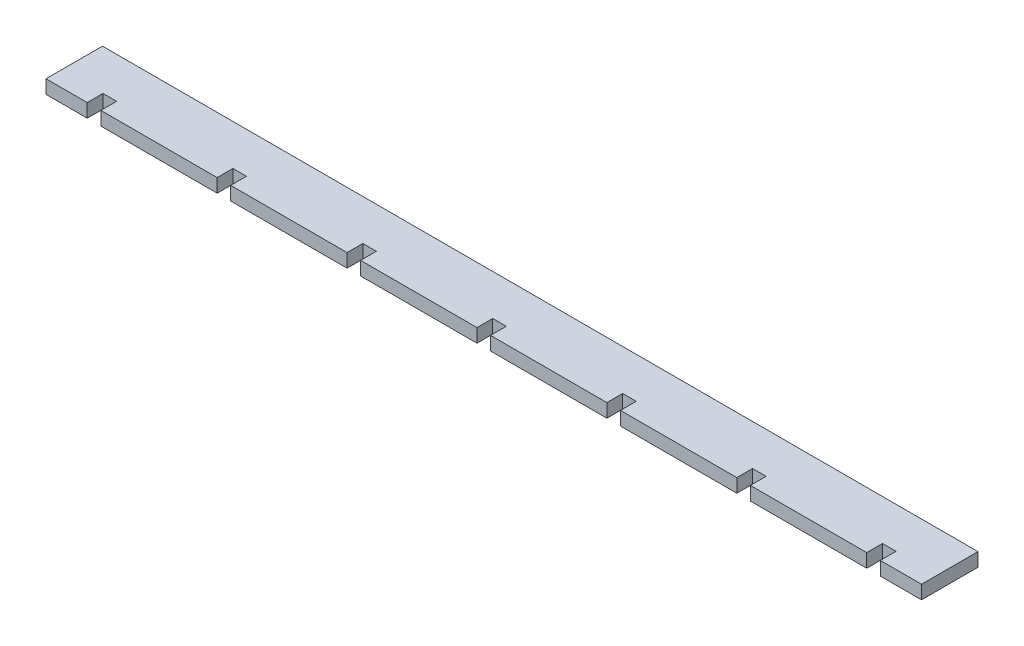
ISO-10303-21;
HEADER;
FILE_DESCRIPTION(('STEP AP214'),'2;1');
FILE_NAME('part.step','',(''),(''),'','','');
FILE_SCHEMA(('AUTOMOTIVE_DESIGN { 1 0 10303 214 1 1 1 1 }'));
ENDSEC;
DATA;
#1=APPLICATION_CONTEXT('core data for automotive mechanical design processes');
#2=APPLICATION_PROTOCOL_DEFINITION('international standard','automotive_design',2000,#1);
#3=PRODUCT_CONTEXT('',#1,'mechanical');
#4=PRODUCT('Part','Part','',(#3));
#5=PRODUCT_RELATED_PRODUCT_CATEGORY('part','',(#4));
#6=PRODUCT_DEFINITION_FORMATION('','',#4);
#7=PRODUCT_DEFINITION_CONTEXT('part definition',#1,'design');
#8=PRODUCT_DEFINITION('design','',#6,#7);
#9=PRODUCT_DEFINITION_SHAPE('','',#8);
#10=(LENGTH_UNIT() NAMED_UNIT(*) SI_UNIT(.MILLI.,.METRE.));
#11=(NAMED_UNIT(*) PLANE_ANGLE_UNIT() SI_UNIT($,.RADIAN.));
#12=(NAMED_UNIT(*) SI_UNIT($,.STERADIAN.) SOLID_ANGLE_UNIT());
#13=UNCERTAINTY_MEASURE_WITH_UNIT(LENGTH_MEASURE(1.E-05),#10,'distance_accuracy_value','');
#14=(GEOMETRIC_REPRESENTATION_CONTEXT(3) GLOBAL_UNCERTAINTY_ASSIGNED_CONTEXT((#13)) GLOBAL_UNIT_ASSIGNED_CONTEXT((#10,
#11,#12)) REPRESENTATION_CONTEXT('',''));
#15=CARTESIAN_POINT('',(0.,0.,0.));
#16=DIRECTION('',(0.,0.,1.));
#17=DIRECTION('',(1.,0.,0.));
#18=AXIS2_PLACEMENT_3D('',#15,#16,#17);
#19=CARTESIAN_POINT('',(-98.425,3.048,0.));
#20=DIRECTION('',(0.,0.,-1.));
#21=DIRECTION('',(-1.,0.,0.));
#22=AXIS2_PLACEMENT_3D('',#19,#20,#21);
#23=PLANE('',#22);
#24=DIRECTION('',(1.,0.,0.));
#25=VECTOR('',#24,1.);
#26=CARTESIAN_POINT('',(-98.425,0.,0.));
#27=LINE('',#26,#25);
#28=CARTESIAN_POINT('',(-98.425,0.,0.));
#29=VERTEX_POINT('',#28);
#30=CARTESIAN_POINT('',(-89.154,0.,0.));
#31=VERTEX_POINT('',#30);
#32=EDGE_CURVE('E328',#29,#31,#27,.T.);
#33=ORIENTED_EDGE('',*,*,#32,.T.);
#34=DIRECTION('',(0.,1.,0.));
#35=VECTOR('',#34,1.);
#36=CARTESIAN_POINT('',(-89.154,0.,0.));
#37=LINE('',#36,#35);
#38=CARTESIAN_POINT('',(-89.154,3.048,0.));
#39=VERTEX_POINT('',#38);
#40=EDGE_CURVE('E313',#31,#39,#37,.T.);
#41=ORIENTED_EDGE('',*,*,#40,.T.);
#42=DIRECTION('',(1.,0.,0.));
#43=VECTOR('',#42,1.);
#44=CARTESIAN_POINT('',(-98.425,3.048,0.));
#45=LINE('',#44,#43);
#46=CARTESIAN_POINT('',(-98.425,3.048,0.));
#47=VERTEX_POINT('',#46);
#48=EDGE_CURVE('E381',#47,#39,#45,.T.);
#49=ORIENTED_EDGE('',*,*,#48,.F.);
#50=DIRECTION('',(0.,-1.,0.));
#51=VECTOR('',#50,1.);
#52=CARTESIAN_POINT('',(-98.425,3.048,0.));
#53=LINE('',#52,#51);
#54=EDGE_CURVE('E12',#47,#29,#53,.T.);
#55=ORIENTED_EDGE('',*,*,#54,.T.);
#56=EDGE_LOOP('',(#33,#41,#49,#55));
#57=FACE_BOUND('',#56,.T.);
#58=ADVANCED_FACE('F41',(#57),#23,.F.);
#59=CARTESIAN_POINT('',(-86.106,3.048,0.));
#60=VERTEX_POINT('',#59);
#61=CARTESIAN_POINT('',(-59.944,3.048,0.));
#62=VERTEX_POINT('',#61);
#63=EDGE_CURVE('E384',#60,#62,#45,.T.);
#64=ORIENTED_EDGE('',*,*,#63,.F.);
#65=DIRECTION('',(0.,1.,0.));
#66=VECTOR('',#65,1.);
#67=CARTESIAN_POINT('',(-86.106,0.,0.));
#68=LINE('',#67,#66);
#69=CARTESIAN_POINT('',(-86.106,0.,0.));
#70=VERTEX_POINT('',#69);
#71=EDGE_CURVE('E323',#70,#60,#68,.T.);
#72=ORIENTED_EDGE('',*,*,#71,.F.);
#73=CARTESIAN_POINT('',(-59.944,0.,0.));
#74=VERTEX_POINT('',#73);
#75=EDGE_CURVE('E338',#70,#74,#27,.T.);
#76=ORIENTED_EDGE('',*,*,#75,.T.);
#77=DIRECTION('',(0.,1.,0.));
#78=VECTOR('',#77,1.);
#79=CARTESIAN_POINT('',(-59.944,0.,0.));
#80=LINE('',#79,#78);
#81=EDGE_CURVE('E650',#74,#62,#80,.T.);
#82=ORIENTED_EDGE('',*,*,#81,.T.);
#83=EDGE_LOOP('',(#64,#72,#76,#82));
#84=FACE_BOUND('',#83,.T.);
#85=ADVANCED_FACE('F517',(#84),#23,.F.);
#86=CARTESIAN_POINT('',(-56.896,3.048,0.));
#87=VERTEX_POINT('',#86);
#88=CARTESIAN_POINT('',(-30.734,3.048,0.));
#89=VERTEX_POINT('',#88);
#90=EDGE_CURVE('E849',#87,#89,#45,.T.);
#91=ORIENTED_EDGE('',*,*,#90,.F.);
#92=DIRECTION('',(0.,1.,0.));
#93=VECTOR('',#92,1.);
#94=CARTESIAN_POINT('',(-56.896,0.,0.));
#95=LINE('',#94,#93);
#96=CARTESIAN_POINT('',(-56.896,0.,0.));
#97=VERTEX_POINT('',#96);
#98=EDGE_CURVE('E670',#97,#87,#95,.T.);
#99=ORIENTED_EDGE('',*,*,#98,.F.);
#100=CARTESIAN_POINT('',(-30.734,0.,0.));
#101=VERTEX_POINT('',#100);
#102=EDGE_CURVE('E345',#97,#101,#27,.T.);
#103=ORIENTED_EDGE('',*,*,#102,.T.);
#104=DIRECTION('',(0.,1.,0.));
#105=VECTOR('',#104,1.);
#106=CARTESIAN_POINT('',(-30.734,0.,0.));
#107=LINE('',#106,#105);
#108=EDGE_CURVE('E689',#101,#89,#107,.T.);
#109=ORIENTED_EDGE('',*,*,#108,.T.);
#110=EDGE_LOOP('',(#91,#99,#103,#109));
#111=FACE_BOUND('',#110,.T.);
#112=ADVANCED_FACE('F523',(#111),#23,.F.);
#113=CARTESIAN_POINT('',(-27.686,3.048,0.));
#114=VERTEX_POINT('',#113);
#115=CARTESIAN_POINT('',(-1.524,3.048,0.));
#116=VERTEX_POINT('',#115);
#117=EDGE_CURVE('E853',#114,#116,#45,.T.);
#118=ORIENTED_EDGE('',*,*,#117,.F.);
#119=DIRECTION('',(0.,1.,0.));
#120=VECTOR('',#119,1.);
#121=CARTESIAN_POINT('',(-27.686,0.,0.));
#122=LINE('',#121,#120);
#123=CARTESIAN_POINT('',(-27.686,0.,0.));
#124=VERTEX_POINT('',#123);
#125=EDGE_CURVE('E709',#124,#114,#122,.T.);
#126=ORIENTED_EDGE('',*,*,#125,.F.);
#127=CARTESIAN_POINT('',(-1.524,0.,0.));
#128=VERTEX_POINT('',#127);
#129=EDGE_CURVE('E824',#124,#128,#27,.T.);
#130=ORIENTED_EDGE('',*,*,#129,.T.);
#131=DIRECTION('',(0.,1.,0.));
#132=VECTOR('',#131,1.);
#133=CARTESIAN_POINT('',(-1.524,0.,0.));
#134=LINE('',#133,#132);
#135=EDGE_CURVE('E728',#128,#116,#134,.T.);
#136=ORIENTED_EDGE('',*,*,#135,.T.);
#137=EDGE_LOOP('',(#118,#126,#130,#136));
#138=FACE_BOUND('',#137,.T.);
#139=ADVANCED_FACE('F875',(#138),#23,.F.);
#140=CARTESIAN_POINT('',(1.524,3.048,0.));
#141=VERTEX_POINT('',#140);
#142=CARTESIAN_POINT('',(27.686,3.048,0.));
#143=VERTEX_POINT('',#142);
#144=EDGE_CURVE('E857',#141,#143,#45,.T.);
#145=ORIENTED_EDGE('',*,*,#144,.F.);
#146=DIRECTION('',(0.,1.,0.));
#147=VECTOR('',#146,1.);
#148=CARTESIAN_POINT('',(1.524,0.,0.));
#149=LINE('',#148,#147);
#150=CARTESIAN_POINT('',(1.524,0.,0.));
#151=VERTEX_POINT('',#150);
#152=EDGE_CURVE('E748',#151,#141,#149,.T.);
#153=ORIENTED_EDGE('',*,*,#152,.F.);
#154=CARTESIAN_POINT('',(27.686,0.,0.));
#155=VERTEX_POINT('',#154);
#156=EDGE_CURVE('E822',#151,#155,#27,.T.);
#157=ORIENTED_EDGE('',*,*,#156,.T.);
#158=DIRECTION('',(0.,1.,0.));
#159=VECTOR('',#158,1.);
#160=CARTESIAN_POINT('',(27.686,0.,0.));
#161=LINE('',#160,#159);
#162=EDGE_CURVE('E767',#155,#143,#161,.T.);
#163=ORIENTED_EDGE('',*,*,#162,.T.);
#164=EDGE_LOOP('',(#145,#153,#157,#163));
#165=FACE_BOUND('',#164,.T.);
#166=ADVANCED_FACE('F870',(#165),#23,.F.);
#167=CARTESIAN_POINT('',(30.734,3.048,0.));
#168=VERTEX_POINT('',#167);
#169=CARTESIAN_POINT('',(56.896,3.048,0.));
#170=VERTEX_POINT('',#169);
#171=EDGE_CURVE('E486',#168,#170,#45,.T.);
#172=ORIENTED_EDGE('',*,*,#171,.F.);
#173=DIRECTION('',(0.,1.,0.));
#174=VECTOR('',#173,1.);
#175=CARTESIAN_POINT('',(30.734,0.,0.));
#176=LINE('',#175,#174);
#177=CARTESIAN_POINT('',(30.734,0.,0.));
#178=VERTEX_POINT('',#177);
#179=EDGE_CURVE('E787',#178,#168,#176,.T.);
#180=ORIENTED_EDGE('',*,*,#179,.F.);
#181=CARTESIAN_POINT('',(56.896,0.,0.));
#182=VERTEX_POINT('',#181);
#183=EDGE_CURVE('E358',#178,#182,#27,.T.);
#184=ORIENTED_EDGE('',*,*,#183,.T.);
#185=DIRECTION('',(0.,1.,0.));
#186=VECTOR('',#185,1.);
#187=CARTESIAN_POINT('',(56.896,0.,0.));
#188=LINE('',#187,#186);
#189=EDGE_CURVE('E473',#182,#170,#188,.T.);
#190=ORIENTED_EDGE('',*,*,#189,.T.);
#191=EDGE_LOOP('',(#172,#180,#184,#190));
#192=FACE_BOUND('',#191,.T.);
#193=ADVANCED_FACE('F514',(#192),#23,.F.);
#194=CARTESIAN_POINT('',(59.944,3.048,0.));
#195=VERTEX_POINT('',#194);
#196=CARTESIAN_POINT('',(86.106,3.048,0.));
#197=VERTEX_POINT('',#196);
#198=EDGE_CURVE('E483',#195,#197,#45,.T.);
#199=ORIENTED_EDGE('',*,*,#198,.F.);
#200=DIRECTION('',(0.,1.,0.));
#201=VECTOR('',#200,1.);
#202=CARTESIAN_POINT('',(59.944,0.,0.));
#203=LINE('',#202,#201);
#204=CARTESIAN_POINT('',(59.944,0.,0.));
#205=VERTEX_POINT('',#204);
#206=EDGE_CURVE('E465',#205,#195,#203,.T.);
#207=ORIENTED_EDGE('',*,*,#206,.F.);
#208=CARTESIAN_POINT('',(86.106,0.,0.));
#209=VERTEX_POINT('',#208);
#210=EDGE_CURVE('E348',#205,#209,#27,.T.);
#211=ORIENTED_EDGE('',*,*,#210,.T.);
#212=DIRECTION('',(0.,1.,0.));
#213=VECTOR('',#212,1.);
#214=CARTESIAN_POINT('',(86.106,0.,0.));
#215=LINE('',#214,#213);
#216=EDGE_CURVE('E360',#209,#197,#215,.T.);
#217=ORIENTED_EDGE('',*,*,#216,.T.);
#218=EDGE_LOOP('',(#199,#207,#211,#217));
#219=FACE_BOUND('',#218,.T.);
#220=ADVANCED_FACE('F508',(#219),#23,.F.);
#221=CARTESIAN_POINT('',(-98.425,3.048,0.));
#222=DIRECTION('',(1.,0.,0.));
#223=DIRECTION('',(0.,0.,-1.));
#224=AXIS2_PLACEMENT_3D('',#221,#222,#223);
#225=PLANE('',#224);
#226=DIRECTION('',(0.,0.,1.));
#227=VECTOR('',#226,1.);
#228=CARTESIAN_POINT('',(-98.425,0.,0.));
#229=LINE('',#228,#227);
#230=CARTESIAN_POINT('',(-98.425,0.,-12.7));
#231=VERTEX_POINT('',#230);
#232=EDGE_CURVE('E349',#231,#29,#229,.T.);
#233=ORIENTED_EDGE('',*,*,#232,.T.);
#234=ORIENTED_EDGE('',*,*,#54,.F.);
#235=DIRECTION('',(0.,0.,1.));
#236=VECTOR('',#235,1.);
#237=CARTESIAN_POINT('',(-98.425,3.048,0.));
#238=LINE('',#237,#236);
#239=CARTESIAN_POINT('',(-98.425,3.048,-12.7));
#240=VERTEX_POINT('',#239);
#241=EDGE_CURVE('E386',#240,#47,#238,.T.);
#242=ORIENTED_EDGE('',*,*,#241,.F.);
#243=DIRECTION('',(0.,-1.,0.));
#244=VECTOR('',#243,1.);
#245=CARTESIAN_POINT('',(-98.425,3.048,-12.7));
#246=LINE('',#245,#244);
#247=EDGE_CURVE('E372',#240,#231,#246,.T.);
#248=ORIENTED_EDGE('',*,*,#247,.T.);
#249=EDGE_LOOP('',(#233,#234,#242,#248));
#250=FACE_BOUND('',#249,.T.);
#251=ADVANCED_FACE('F43',(#250),#225,.F.);
#252=CARTESIAN_POINT('',(89.154,3.048,0.));
#253=VERTEX_POINT('',#252);
#254=CARTESIAN_POINT('',(98.425,3.048,0.));
#255=VERTEX_POINT('',#254);
#256=EDGE_CURVE('E385',#253,#255,#45,.T.);
#257=ORIENTED_EDGE('',*,*,#256,.F.);
#258=DIRECTION('',(0.,1.,0.));
#259=VECTOR('',#258,1.);
#260=CARTESIAN_POINT('',(89.154,0.,0.));
#261=LINE('',#260,#259);
#262=CARTESIAN_POINT('',(89.154,0.,0.));
#263=VERTEX_POINT('',#262);
#264=EDGE_CURVE('E431',#263,#253,#261,.T.);
#265=ORIENTED_EDGE('',*,*,#264,.F.);
#266=CARTESIAN_POINT('',(98.425,0.,0.));
#267=VERTEX_POINT('',#266);
#268=EDGE_CURVE('E340',#263,#267,#27,.T.);
#269=ORIENTED_EDGE('',*,*,#268,.T.);
#270=DIRECTION('',(0.,-1.,0.));
#271=VECTOR('',#270,1.);
#272=CARTESIAN_POINT('',(98.425,3.048,0.));
#273=LINE('',#272,#271);
#274=EDGE_CURVE('E50',#255,#267,#273,.T.);
#275=ORIENTED_EDGE('',*,*,#274,.F.);
#276=EDGE_LOOP('',(#257,#265,#269,#275));
#277=FACE_BOUND('',#276,.T.);
#278=ADVANCED_FACE('F480',(#277),#23,.F.);
#279=CARTESIAN_POINT('',(98.425,3.048,0.));
#280=DIRECTION('',(-1.,0.,0.));
#281=DIRECTION('',(0.,0.,1.));
#282=AXIS2_PLACEMENT_3D('',#279,#280,#281);
#283=PLANE('',#282);
#284=DIRECTION('',(0.,0.,-1.));
#285=VECTOR('',#284,1.);
#286=CARTESIAN_POINT('',(98.425,0.,0.));
#287=LINE('',#286,#285);
#288=CARTESIAN_POINT('',(98.425,0.,-12.7));
#289=VERTEX_POINT('',#288);
#290=EDGE_CURVE('E337',#267,#289,#287,.T.);
#291=ORIENTED_EDGE('',*,*,#290,.T.);
#292=DIRECTION('',(0.,-1.,0.));
#293=VECTOR('',#292,1.);
#294=CARTESIAN_POINT('',(98.425,3.048,-12.7));
#295=LINE('',#294,#293);
#296=CARTESIAN_POINT('',(98.425,3.048,-12.7));
#297=VERTEX_POINT('',#296);
#298=EDGE_CURVE('E500',#297,#289,#295,.T.);
#299=ORIENTED_EDGE('',*,*,#298,.F.);
#300=DIRECTION('',(0.,0.,-1.));
#301=VECTOR('',#300,1.);
#302=CARTESIAN_POINT('',(98.425,3.048,0.));
#303=LINE('',#302,#301);
#304=EDGE_CURVE('E373',#255,#297,#303,.T.);
#305=ORIENTED_EDGE('',*,*,#304,.F.);
#306=ORIENTED_EDGE('',*,*,#274,.T.);
#307=EDGE_LOOP('',(#291,#299,#305,#306));
#308=FACE_BOUND('',#307,.T.);
#309=ADVANCED_FACE('F502',(#308),#283,.F.);
#310=CARTESIAN_POINT('',(-98.425,3.048,-12.7));
#311=DIRECTION('',(0.,0.,1.));
#312=DIRECTION('',(1.,0.,0.));
#313=AXIS2_PLACEMENT_3D('',#310,#311,#312);
#314=PLANE('',#313);
#315=DIRECTION('',(-1.,0.,0.));
#316=VECTOR('',#315,1.);
#317=CARTESIAN_POINT('',(-98.425,0.,-12.7));
#318=LINE('',#317,#316);
#319=EDGE_CURVE('E342',#289,#231,#318,.T.);
#320=ORIENTED_EDGE('',*,*,#319,.T.);
#321=ORIENTED_EDGE('',*,*,#247,.F.);
#322=DIRECTION('',(-1.,0.,0.));
#323=VECTOR('',#322,1.);
#324=CARTESIAN_POINT('',(-98.425,3.048,-12.7));
#325=LINE('',#324,#323);
#326=EDGE_CURVE('E368',#297,#240,#325,.T.);
#327=ORIENTED_EDGE('',*,*,#326,.F.);
#328=ORIENTED_EDGE('',*,*,#298,.T.);
#329=EDGE_LOOP('',(#320,#321,#327,#328));
#330=FACE_BOUND('',#329,.T.);
#331=ADVANCED_FACE('F506',(#330),#314,.F.);
#332=CARTESIAN_POINT('',(0.,3.048,0.));
#333=DIRECTION('',(0.,-1.,0.));
#334=DIRECTION('',(0.,0.,-1.));
#335=AXIS2_PLACEMENT_3D('',#332,#333,#334);
#336=PLANE('',#335);
#337=ORIENTED_EDGE('',*,*,#48,.T.);
#338=DIRECTION('',(0.,0.,1.));
#339=VECTOR('',#338,1.);
#340=CARTESIAN_POINT('',(-89.154,3.048,-3.54116052481452));
#341=LINE('',#340,#339);
#342=CARTESIAN_POINT('',(-89.154,3.048,-3.54116052481452));
#343=VERTEX_POINT('',#342);
#344=EDGE_CURVE('E318',#343,#39,#341,.T.);
#345=ORIENTED_EDGE('',*,*,#344,.F.);
#346=DIRECTION('',(-1.,0.,0.));
#347=VECTOR('',#346,1.);
#348=CARTESIAN_POINT('',(-89.154,3.048,-3.54116052481452));
#349=LINE('',#348,#347);
#350=CARTESIAN_POINT('',(-86.106,3.048,-3.54116052481452));
#351=VERTEX_POINT('',#350);
#352=EDGE_CURVE('E332',#351,#343,#349,.T.);
#353=ORIENTED_EDGE('',*,*,#352,.F.);
#354=DIRECTION('',(0.,0.,-1.));
#355=VECTOR('',#354,1.);
#356=CARTESIAN_POINT('',(-86.106,3.048,-3.54116052481452));
#357=LINE('',#356,#355);
#358=EDGE_CURVE('E619',#60,#351,#357,.T.);
#359=ORIENTED_EDGE('',*,*,#358,.F.);
#360=ORIENTED_EDGE('',*,*,#63,.T.);
#361=DIRECTION('',(0.,0.,1.));
#362=VECTOR('',#361,1.);
#363=CARTESIAN_POINT('',(-59.944,3.048,-3.54116052481452));
#364=LINE('',#363,#362);
#365=CARTESIAN_POINT('',(-59.944,3.048,-3.54116052481452));
#366=VERTEX_POINT('',#365);
#367=EDGE_CURVE('E634',#366,#62,#364,.T.);
#368=ORIENTED_EDGE('',*,*,#367,.F.);
#369=DIRECTION('',(-1.,0.,0.));
#370=VECTOR('',#369,1.);
#371=CARTESIAN_POINT('',(-59.944,3.048,-3.54116052481452));
#372=LINE('',#371,#370);
#373=CARTESIAN_POINT('',(-56.896,3.048,-3.54116052481452));
#374=VERTEX_POINT('',#373);
#375=EDGE_CURVE('E644',#374,#366,#372,.T.);
#376=ORIENTED_EDGE('',*,*,#375,.F.);
#377=DIRECTION('',(0.,0.,-1.));
#378=VECTOR('',#377,1.);
#379=CARTESIAN_POINT('',(-56.896,3.048,-3.54116052481452));
#380=LINE('',#379,#378);
#381=EDGE_CURVE('E655',#87,#374,#380,.T.);
#382=ORIENTED_EDGE('',*,*,#381,.F.);
#383=ORIENTED_EDGE('',*,*,#90,.T.);
#384=DIRECTION('',(0.,0.,1.));
#385=VECTOR('',#384,1.);
#386=CARTESIAN_POINT('',(-30.734,3.048,-3.54116052481452));
#387=LINE('',#386,#385);
#388=CARTESIAN_POINT('',(-30.734,3.048,-3.54116052481452));
#389=VERTEX_POINT('',#388);
#390=EDGE_CURVE('E666',#389,#89,#387,.T.);
#391=ORIENTED_EDGE('',*,*,#390,.F.);
#392=DIRECTION('',(-1.,0.,0.));
#393=VECTOR('',#392,1.);
#394=CARTESIAN_POINT('',(-30.734,3.048,-3.54116052481452));
#395=LINE('',#394,#393);
#396=CARTESIAN_POINT('',(-27.686,3.048,-3.54116052481452));
#397=VERTEX_POINT('',#396);
#398=EDGE_CURVE('E681',#397,#389,#395,.T.);
#399=ORIENTED_EDGE('',*,*,#398,.F.);
#400=DIRECTION('',(0.,0.,-1.));
#401=VECTOR('',#400,1.);
#402=CARTESIAN_POINT('',(-27.686,3.048,-3.54116052481452));
#403=LINE('',#402,#401);
#404=EDGE_CURVE('E694',#114,#397,#403,.T.);
#405=ORIENTED_EDGE('',*,*,#404,.F.);
#406=ORIENTED_EDGE('',*,*,#117,.T.);
#407=DIRECTION('',(0.,0.,1.));
#408=VECTOR('',#407,1.);
#409=CARTESIAN_POINT('',(-1.524,3.048,-3.54116052481452));
#410=LINE('',#409,#408);
#411=CARTESIAN_POINT('',(-1.524,3.048,-3.54116052481452));
#412=VERTEX_POINT('',#411);
#413=EDGE_CURVE('E705',#412,#116,#410,.T.);
#414=ORIENTED_EDGE('',*,*,#413,.F.);
#415=DIRECTION('',(-1.,0.,0.));
#416=VECTOR('',#415,1.);
#417=CARTESIAN_POINT('',(-1.524,3.048,-3.54116052481452));
#418=LINE('',#417,#416);
#419=CARTESIAN_POINT('',(1.524,3.048,-3.54116052481452));
#420=VERTEX_POINT('',#419);
#421=EDGE_CURVE('E720',#420,#412,#418,.T.);
#422=ORIENTED_EDGE('',*,*,#421,.F.);
#423=DIRECTION('',(0.,0.,-1.));
#424=VECTOR('',#423,1.);
#425=CARTESIAN_POINT('',(1.524,3.048,-3.54116052481452));
#426=LINE('',#425,#424);
#427=EDGE_CURVE('E733',#141,#420,#426,.T.);
#428=ORIENTED_EDGE('',*,*,#427,.F.);
#429=ORIENTED_EDGE('',*,*,#144,.T.);
#430=DIRECTION('',(0.,0.,1.));
#431=VECTOR('',#430,1.);
#432=CARTESIAN_POINT('',(27.686,3.048,-3.54116052481452));
#433=LINE('',#432,#431);
#434=CARTESIAN_POINT('',(27.686,3.048,-3.54116052481452));
#435=VERTEX_POINT('',#434);
#436=EDGE_CURVE('E744',#435,#143,#433,.T.);
#437=ORIENTED_EDGE('',*,*,#436,.F.);
#438=DIRECTION('',(-1.,0.,0.));
#439=VECTOR('',#438,1.);
#440=CARTESIAN_POINT('',(27.686,3.048,-3.54116052481452));
#441=LINE('',#440,#439);
#442=CARTESIAN_POINT('',(30.734,3.048,-3.54116052481452));
#443=VERTEX_POINT('',#442);
#444=EDGE_CURVE('E759',#443,#435,#441,.T.);
#445=ORIENTED_EDGE('',*,*,#444,.F.);
#446=DIRECTION('',(0.,0.,-1.));
#447=VECTOR('',#446,1.);
#448=CARTESIAN_POINT('',(30.734,3.048,-3.54116052481452));
#449=LINE('',#448,#447);
#450=EDGE_CURVE('E772',#168,#443,#449,.T.);
#451=ORIENTED_EDGE('',*,*,#450,.F.);
#452=ORIENTED_EDGE('',*,*,#171,.T.);
#453=DIRECTION('',(0.,0.,1.));
#454=VECTOR('',#453,1.);
#455=CARTESIAN_POINT('',(56.896,3.048,-3.54116052481452));
#456=LINE('',#455,#454);
#457=CARTESIAN_POINT('',(56.896,3.048,-3.54116052481452));
#458=VERTEX_POINT('',#457);
#459=EDGE_CURVE('E783',#458,#170,#456,.T.);
#460=ORIENTED_EDGE('',*,*,#459,.F.);
#461=DIRECTION('',(-1.,0.,0.));
#462=VECTOR('',#461,1.);
#463=CARTESIAN_POINT('',(56.896,3.048,-3.54116052481452));
#464=LINE('',#463,#462);
#465=CARTESIAN_POINT('',(59.944,3.048,-3.54116052481452));
#466=VERTEX_POINT('',#465);
#467=EDGE_CURVE('E468',#466,#458,#464,.T.);
#468=ORIENTED_EDGE('',*,*,#467,.F.);
#469=DIRECTION('',(0.,0.,-1.));
#470=VECTOR('',#469,1.);
#471=CARTESIAN_POINT('',(59.944,3.048,-3.54116052481452));
#472=LINE('',#471,#470);
#473=EDGE_CURVE('E806',#195,#466,#472,.T.);
#474=ORIENTED_EDGE('',*,*,#473,.F.);
#475=ORIENTED_EDGE('',*,*,#198,.T.);
#476=DIRECTION('',(0.,0.,1.));
#477=VECTOR('',#476,1.);
#478=CARTESIAN_POINT('',(86.106,3.048,-3.54116052481452));
#479=LINE('',#478,#477);
#480=CARTESIAN_POINT('',(86.106,3.048,-3.54116052481452));
#481=VERTEX_POINT('',#480);
#482=EDGE_CURVE('E420',#481,#197,#479,.T.);
#483=ORIENTED_EDGE('',*,*,#482,.F.);
#484=DIRECTION('',(-1.,0.,0.));
#485=VECTOR('',#484,1.);
#486=CARTESIAN_POINT('',(89.154,3.048,-3.54116052481452));
#487=LINE('',#486,#485);
#488=CARTESIAN_POINT('',(89.154,3.048,-3.54116052481452));
#489=VERTEX_POINT('',#488);
#490=EDGE_CURVE('E425',#489,#481,#487,.T.);
#491=ORIENTED_EDGE('',*,*,#490,.F.);
#492=DIRECTION('',(0.,0.,-1.));
#493=VECTOR('',#492,1.);
#494=CARTESIAN_POINT('',(89.154,3.048,0.));
#495=LINE('',#494,#493);
#496=EDGE_CURVE('E448',#253,#489,#495,.T.);
#497=ORIENTED_EDGE('',*,*,#496,.F.);
#498=ORIENTED_EDGE('',*,*,#256,.T.);
#499=ORIENTED_EDGE('',*,*,#304,.T.);
#500=ORIENTED_EDGE('',*,*,#326,.T.);
#501=ORIENTED_EDGE('',*,*,#241,.T.);
#502=EDGE_LOOP('',(#337,#345,#353,#359,#360,#368,#376,#382,#383,#391,#399,#405,#406,#414,#422,
#428,#429,#437,#445,#451,#452,#460,#468,#474,#475,#483,#491,#497,#498,#499,#500,#501));
#503=FACE_BOUND('',#502,.T.);
#504=ADVANCED_FACE('F505',(#503),#336,.F.);
#505=CARTESIAN_POINT('',(0.,0.,0.));
#506=DIRECTION('',(0.,-1.,0.));
#507=DIRECTION('',(0.,0.,-1.));
#508=AXIS2_PLACEMENT_3D('',#505,#506,#507);
#509=PLANE('',#508);
#510=DIRECTION('',(0.,0.,1.));
#511=VECTOR('',#510,1.);
#512=CARTESIAN_POINT('',(-89.154,0.,-3.54116052481452));
#513=LINE('',#512,#511);
#514=CARTESIAN_POINT('',(-89.154,0.,-3.54116052481452));
#515=VERTEX_POINT('',#514);
#516=EDGE_CURVE('E316',#515,#31,#513,.T.);
#517=ORIENTED_EDGE('',*,*,#516,.T.);
#518=ORIENTED_EDGE('',*,*,#32,.F.);
#519=ORIENTED_EDGE('',*,*,#232,.F.);
#520=ORIENTED_EDGE('',*,*,#319,.F.);
#521=ORIENTED_EDGE('',*,*,#290,.F.);
#522=ORIENTED_EDGE('',*,*,#268,.F.);
#523=DIRECTION('',(0.,0.,-1.));
#524=VECTOR('',#523,1.);
#525=CARTESIAN_POINT('',(89.154,0.,0.));
#526=LINE('',#525,#524);
#527=CARTESIAN_POINT('',(89.154,0.,-3.54116052481452));
#528=VERTEX_POINT('',#527);
#529=EDGE_CURVE('E424',#263,#528,#526,.T.);
#530=ORIENTED_EDGE('',*,*,#529,.T.);
#531=DIRECTION('',(-1.,0.,0.));
#532=VECTOR('',#531,1.);
#533=CARTESIAN_POINT('',(89.154,0.,-3.54116052481452));
#534=LINE('',#533,#532);
#535=CARTESIAN_POINT('',(86.106,0.,-3.54116052481452));
#536=VERTEX_POINT('',#535);
#537=EDGE_CURVE('E439',#528,#536,#534,.T.);
#538=ORIENTED_EDGE('',*,*,#537,.T.);
#539=DIRECTION('',(0.,0.,1.));
#540=VECTOR('',#539,1.);
#541=CARTESIAN_POINT('',(86.106,0.,-3.54116052481452));
#542=LINE('',#541,#540);
#543=EDGE_CURVE('E433',#536,#209,#542,.T.);
#544=ORIENTED_EDGE('',*,*,#543,.T.);
#545=ORIENTED_EDGE('',*,*,#210,.F.);
#546=DIRECTION('',(0.,0.,-1.));
#547=VECTOR('',#546,1.);
#548=CARTESIAN_POINT('',(59.944,0.,-3.54116052481452));
#549=LINE('',#548,#547);
#550=CARTESIAN_POINT('',(59.944,0.,-3.54116052481452));
#551=VERTEX_POINT('',#550);
#552=EDGE_CURVE('E797',#205,#551,#549,.T.);
#553=ORIENTED_EDGE('',*,*,#552,.T.);
#554=DIRECTION('',(-1.,0.,0.));
#555=VECTOR('',#554,1.);
#556=CARTESIAN_POINT('',(56.896,0.,-3.54116052481452));
#557=LINE('',#556,#555);
#558=CARTESIAN_POINT('',(56.896,0.,-3.54116052481452));
#559=VERTEX_POINT('',#558);
#560=EDGE_CURVE('E475',#551,#559,#557,.T.);
#561=ORIENTED_EDGE('',*,*,#560,.T.);
#562=DIRECTION('',(0.,0.,1.));
#563=VECTOR('',#562,1.);
#564=CARTESIAN_POINT('',(56.896,0.,-3.54116052481452));
#565=LINE('',#564,#563);
#566=EDGE_CURVE('E793',#559,#182,#565,.T.);
#567=ORIENTED_EDGE('',*,*,#566,.T.);
#568=ORIENTED_EDGE('',*,*,#183,.F.);
#569=DIRECTION('',(0.,0.,-1.));
#570=VECTOR('',#569,1.);
#571=CARTESIAN_POINT('',(30.734,0.,-3.54116052481452));
#572=LINE('',#571,#570);
#573=CARTESIAN_POINT('',(30.734,0.,-3.54116052481452));
#574=VERTEX_POINT('',#573);
#575=EDGE_CURVE('E758',#178,#574,#572,.T.);
#576=ORIENTED_EDGE('',*,*,#575,.T.);
#577=DIRECTION('',(-1.,0.,0.));
#578=VECTOR('',#577,1.);
#579=CARTESIAN_POINT('',(27.686,0.,-3.54116052481452));
#580=LINE('',#579,#578);
#581=CARTESIAN_POINT('',(27.686,0.,-3.54116052481452));
#582=VERTEX_POINT('',#581);
#583=EDGE_CURVE('E763',#574,#582,#580,.T.);
#584=ORIENTED_EDGE('',*,*,#583,.T.);
#585=DIRECTION('',(0.,0.,1.));
#586=VECTOR('',#585,1.);
#587=CARTESIAN_POINT('',(27.686,0.,-3.54116052481452));
#588=LINE('',#587,#586);
#589=EDGE_CURVE('E754',#582,#155,#588,.T.);
#590=ORIENTED_EDGE('',*,*,#589,.T.);
#591=ORIENTED_EDGE('',*,*,#156,.F.);
#592=DIRECTION('',(0.,0.,-1.));
#593=VECTOR('',#592,1.);
#594=CARTESIAN_POINT('',(1.524,0.,-3.54116052481452));
#595=LINE('',#594,#593);
#596=CARTESIAN_POINT('',(1.524,0.,-3.54116052481452));
#597=VERTEX_POINT('',#596);
#598=EDGE_CURVE('E719',#151,#597,#595,.T.);
#599=ORIENTED_EDGE('',*,*,#598,.T.);
#600=DIRECTION('',(-1.,0.,0.));
#601=VECTOR('',#600,1.);
#602=CARTESIAN_POINT('',(-1.524,0.,-3.54116052481452));
#603=LINE('',#602,#601);
#604=CARTESIAN_POINT('',(-1.524,0.,-3.54116052481452));
#605=VERTEX_POINT('',#604);
#606=EDGE_CURVE('E724',#597,#605,#603,.T.);
#607=ORIENTED_EDGE('',*,*,#606,.T.);
#608=DIRECTION('',(0.,0.,1.));
#609=VECTOR('',#608,1.);
#610=CARTESIAN_POINT('',(-1.524,0.,-3.54116052481452));
#611=LINE('',#610,#609);
#612=EDGE_CURVE('E715',#605,#128,#611,.T.);
#613=ORIENTED_EDGE('',*,*,#612,.T.);
#614=ORIENTED_EDGE('',*,*,#129,.F.);
#615=DIRECTION('',(0.,0.,-1.));
#616=VECTOR('',#615,1.);
#617=CARTESIAN_POINT('',(-27.686,0.,-3.54116052481452));
#618=LINE('',#617,#616);
#619=CARTESIAN_POINT('',(-27.686,0.,-3.54116052481452));
#620=VERTEX_POINT('',#619);
#621=EDGE_CURVE('E680',#124,#620,#618,.T.);
#622=ORIENTED_EDGE('',*,*,#621,.T.);
#623=DIRECTION('',(-1.,0.,0.));
#624=VECTOR('',#623,1.);
#625=CARTESIAN_POINT('',(-30.734,0.,-3.54116052481452));
#626=LINE('',#625,#624);
#627=CARTESIAN_POINT('',(-30.734,0.,-3.54116052481452));
#628=VERTEX_POINT('',#627);
#629=EDGE_CURVE('E685',#620,#628,#626,.T.);
#630=ORIENTED_EDGE('',*,*,#629,.T.);
#631=DIRECTION('',(0.,0.,1.));
#632=VECTOR('',#631,1.);
#633=CARTESIAN_POINT('',(-30.734,0.,-3.54116052481452));
#634=LINE('',#633,#632);
#635=EDGE_CURVE('E676',#628,#101,#634,.T.);
#636=ORIENTED_EDGE('',*,*,#635,.T.);
#637=ORIENTED_EDGE('',*,*,#102,.F.);
#638=DIRECTION('',(0.,0.,-1.));
#639=VECTOR('',#638,1.);
#640=CARTESIAN_POINT('',(-56.896,0.,-3.54116052481452));
#641=LINE('',#640,#639);
#642=CARTESIAN_POINT('',(-56.896,0.,-3.54116052481452));
#643=VERTEX_POINT('',#642);
#644=EDGE_CURVE('E643',#97,#643,#641,.T.);
#645=ORIENTED_EDGE('',*,*,#644,.T.);
#646=DIRECTION('',(-1.,0.,0.));
#647=VECTOR('',#646,1.);
#648=CARTESIAN_POINT('',(-59.944,0.,-3.54116052481452));
#649=LINE('',#648,#647);
#650=CARTESIAN_POINT('',(-59.944,0.,-3.54116052481452));
#651=VERTEX_POINT('',#650);
#652=EDGE_CURVE('E71',#643,#651,#649,.T.);
#653=ORIENTED_EDGE('',*,*,#652,.T.);
#654=DIRECTION('',(0.,0.,1.));
#655=VECTOR('',#654,1.);
#656=CARTESIAN_POINT('',(-59.944,0.,-3.54116052481452));
#657=LINE('',#656,#655);
#658=EDGE_CURVE('E639',#651,#74,#657,.T.);
#659=ORIENTED_EDGE('',*,*,#658,.T.);
#660=ORIENTED_EDGE('',*,*,#75,.F.);
#661=DIRECTION('',(0.,0.,-1.));
#662=VECTOR('',#661,1.);
#663=CARTESIAN_POINT('',(-86.106,0.,-3.54116052481452));
#664=LINE('',#663,#662);
#665=CARTESIAN_POINT('',(-86.106,0.,-3.54116052481452));
#666=VERTEX_POINT('',#665);
#667=EDGE_CURVE('E331',#70,#666,#664,.T.);
#668=ORIENTED_EDGE('',*,*,#667,.T.);
#669=DIRECTION('',(-1.,0.,0.));
#670=VECTOR('',#669,1.);
#671=CARTESIAN_POINT('',(-89.154,0.,-3.54116052481452));
#672=LINE('',#671,#670);
#673=EDGE_CURVE('E60',#666,#515,#672,.T.);
#674=ORIENTED_EDGE('',*,*,#673,.T.);
#675=EDGE_LOOP('',(#517,#518,#519,#520,#521,#522,#530,#538,#544,#545,#553,#561,#567,#568,#576,
#584,#590,#591,#599,#607,#613,#614,#622,#630,#636,#637,#645,#653,#659,#660,#668,#674));
#676=FACE_BOUND('',#675,.T.);
#677=ADVANCED_FACE('F326',(#676),#509,.T.);
#678=CARTESIAN_POINT('',(86.106,0.,-3.54116052481452));
#679=DIRECTION('',(-1.,0.,0.));
#680=DIRECTION('',(0.,0.,1.));
#681=AXIS2_PLACEMENT_3D('',#678,#679,#680);
#682=PLANE('',#681);
#683=ORIENTED_EDGE('',*,*,#482,.T.);
#684=ORIENTED_EDGE('',*,*,#216,.F.);
#685=ORIENTED_EDGE('',*,*,#543,.F.);
#686=DIRECTION('',(0.,1.,0.));
#687=VECTOR('',#686,1.);
#688=CARTESIAN_POINT('',(86.106,0.,-3.54116052481452));
#689=LINE('',#688,#687);
#690=EDGE_CURVE('E365',#536,#481,#689,.T.);
#691=ORIENTED_EDGE('',*,*,#690,.T.);
#692=EDGE_LOOP('',(#683,#684,#685,#691));
#693=FACE_BOUND('',#692,.T.);
#694=ADVANCED_FACE('F532',(#693),#682,.F.);
#695=CARTESIAN_POINT('',(89.154,0.,-3.54116052481452));
#696=DIRECTION('',(0.,0.,-1.));
#697=DIRECTION('',(-1.,0.,0.));
#698=AXIS2_PLACEMENT_3D('',#695,#696,#697);
#699=PLANE('',#698);
#700=ORIENTED_EDGE('',*,*,#490,.T.);
#701=ORIENTED_EDGE('',*,*,#690,.F.);
#702=ORIENTED_EDGE('',*,*,#537,.F.);
#703=DIRECTION('',(0.,1.,0.));
#704=VECTOR('',#703,1.);
#705=CARTESIAN_POINT('',(89.154,0.,-3.54116052481452));
#706=LINE('',#705,#704);
#707=EDGE_CURVE('E429',#528,#489,#706,.T.);
#708=ORIENTED_EDGE('',*,*,#707,.T.);
#709=EDGE_LOOP('',(#700,#701,#702,#708));
#710=FACE_BOUND('',#709,.T.);
#711=ADVANCED_FACE('F538',(#710),#699,.F.);
#712=CARTESIAN_POINT('',(89.154,0.,0.));
#713=DIRECTION('',(1.,0.,0.));
#714=DIRECTION('',(0.,0.,-1.));
#715=AXIS2_PLACEMENT_3D('',#712,#713,#714);
#716=PLANE('',#715);
#717=ORIENTED_EDGE('',*,*,#496,.T.);
#718=ORIENTED_EDGE('',*,*,#707,.F.);
#719=ORIENTED_EDGE('',*,*,#529,.F.);
#720=ORIENTED_EDGE('',*,*,#264,.T.);
#721=EDGE_LOOP('',(#717,#718,#719,#720));
#722=FACE_BOUND('',#721,.T.);
#723=ADVANCED_FACE('F478',(#722),#716,.F.);
#724=CARTESIAN_POINT('',(56.896,0.,-3.54116052481452));
#725=DIRECTION('',(-1.,0.,0.));
#726=DIRECTION('',(0.,0.,1.));
#727=AXIS2_PLACEMENT_3D('',#724,#725,#726);
#728=PLANE('',#727);
#729=ORIENTED_EDGE('',*,*,#459,.T.);
#730=ORIENTED_EDGE('',*,*,#189,.F.);
#731=ORIENTED_EDGE('',*,*,#566,.F.);
#732=DIRECTION('',(0.,1.,0.));
#733=VECTOR('',#732,1.);
#734=CARTESIAN_POINT('',(56.896,0.,-3.54116052481452));
#735=LINE('',#734,#733);
#736=EDGE_CURVE('E451',#559,#458,#735,.T.);
#737=ORIENTED_EDGE('',*,*,#736,.T.);
#738=EDGE_LOOP('',(#729,#730,#731,#737));
#739=FACE_BOUND('',#738,.T.);
#740=ADVANCED_FACE('F537',(#739),#728,.F.);
#741=CARTESIAN_POINT('',(56.896,0.,-3.54116052481452));
#742=DIRECTION('',(0.,0.,-1.));
#743=DIRECTION('',(-1.,0.,0.));
#744=AXIS2_PLACEMENT_3D('',#741,#742,#743);
#745=PLANE('',#744);
#746=ORIENTED_EDGE('',*,*,#467,.T.);
#747=ORIENTED_EDGE('',*,*,#736,.F.);
#748=ORIENTED_EDGE('',*,*,#560,.F.);
#749=DIRECTION('',(0.,1.,0.));
#750=VECTOR('',#749,1.);
#751=CARTESIAN_POINT('',(59.944,0.,-3.54116052481452));
#752=LINE('',#751,#750);
#753=EDGE_CURVE('E458',#551,#466,#752,.T.);
#754=ORIENTED_EDGE('',*,*,#753,.T.);
#755=EDGE_LOOP('',(#746,#747,#748,#754));
#756=FACE_BOUND('',#755,.T.);
#757=ADVANCED_FACE('F547',(#756),#745,.F.);
#758=CARTESIAN_POINT('',(59.944,0.,-3.54116052481452));
#759=DIRECTION('',(1.,0.,0.));
#760=DIRECTION('',(0.,0.,-1.));
#761=AXIS2_PLACEMENT_3D('',#758,#759,#760);
#762=PLANE('',#761);
#763=ORIENTED_EDGE('',*,*,#473,.T.);
#764=ORIENTED_EDGE('',*,*,#753,.F.);
#765=ORIENTED_EDGE('',*,*,#552,.F.);
#766=ORIENTED_EDGE('',*,*,#206,.T.);
#767=EDGE_LOOP('',(#763,#764,#765,#766));
#768=FACE_BOUND('',#767,.T.);
#769=ADVANCED_FACE('F548',(#768),#762,.F.);
#770=CARTESIAN_POINT('',(27.686,0.,-3.54116052481452));
#771=DIRECTION('',(-1.,0.,0.));
#772=DIRECTION('',(0.,0.,1.));
#773=AXIS2_PLACEMENT_3D('',#770,#771,#772);
#774=PLANE('',#773);
#775=ORIENTED_EDGE('',*,*,#436,.T.);
#776=ORIENTED_EDGE('',*,*,#162,.F.);
#777=ORIENTED_EDGE('',*,*,#589,.F.);
#778=DIRECTION('',(0.,1.,0.));
#779=VECTOR('',#778,1.);
#780=CARTESIAN_POINT('',(27.686,0.,-3.54116052481452));
#781=LINE('',#780,#779);
#782=EDGE_CURVE('E780',#582,#435,#781,.T.);
#783=ORIENTED_EDGE('',*,*,#782,.T.);
#784=EDGE_LOOP('',(#775,#776,#777,#783));
#785=FACE_BOUND('',#784,.T.);
#786=ADVANCED_FACE('F551',(#785),#774,.F.);
#787=CARTESIAN_POINT('',(27.686,0.,-3.54116052481452));
#788=DIRECTION('',(0.,0.,-1.));
#789=DIRECTION('',(-1.,0.,0.));
#790=AXIS2_PLACEMENT_3D('',#787,#788,#789);
#791=PLANE('',#790);
#792=ORIENTED_EDGE('',*,*,#444,.T.);
#793=ORIENTED_EDGE('',*,*,#782,.F.);
#794=ORIENTED_EDGE('',*,*,#583,.F.);
#795=DIRECTION('',(0.,1.,0.));
#796=VECTOR('',#795,1.);
#797=CARTESIAN_POINT('',(30.734,0.,-3.54116052481452));
#798=LINE('',#797,#796);
#799=EDGE_CURVE('E784',#574,#443,#798,.T.);
#800=ORIENTED_EDGE('',*,*,#799,.T.);
#801=EDGE_LOOP('',(#792,#793,#794,#800));
#802=FACE_BOUND('',#801,.T.);
#803=ADVANCED_FACE('F558',(#802),#791,.F.);
#804=CARTESIAN_POINT('',(30.734,0.,-3.54116052481452));
#805=DIRECTION('',(1.,0.,0.));
#806=DIRECTION('',(0.,0.,-1.));
#807=AXIS2_PLACEMENT_3D('',#804,#805,#806);
#808=PLANE('',#807);
#809=ORIENTED_EDGE('',*,*,#450,.T.);
#810=ORIENTED_EDGE('',*,*,#799,.F.);
#811=ORIENTED_EDGE('',*,*,#575,.F.);
#812=ORIENTED_EDGE('',*,*,#179,.T.);
#813=EDGE_LOOP('',(#809,#810,#811,#812));
#814=FACE_BOUND('',#813,.T.);
#815=ADVANCED_FACE('F560',(#814),#808,.F.);
#816=CARTESIAN_POINT('',(-1.524,0.,-3.54116052481452));
#817=DIRECTION('',(-1.,0.,0.));
#818=DIRECTION('',(0.,0.,1.));
#819=AXIS2_PLACEMENT_3D('',#816,#817,#818);
#820=PLANE('',#819);
#821=ORIENTED_EDGE('',*,*,#413,.T.);
#822=ORIENTED_EDGE('',*,*,#135,.F.);
#823=ORIENTED_EDGE('',*,*,#612,.F.);
#824=DIRECTION('',(0.,1.,0.));
#825=VECTOR('',#824,1.);
#826=CARTESIAN_POINT('',(-1.524,0.,-3.54116052481452));
#827=LINE('',#826,#825);
#828=EDGE_CURVE('E741',#605,#412,#827,.T.);
#829=ORIENTED_EDGE('',*,*,#828,.T.);
#830=EDGE_LOOP('',(#821,#822,#823,#829));
#831=FACE_BOUND('',#830,.T.);
#832=ADVANCED_FACE('F563',(#831),#820,.F.);
#833=CARTESIAN_POINT('',(-1.524,0.,-3.54116052481452));
#834=DIRECTION('',(0.,0.,-1.));
#835=DIRECTION('',(-1.,0.,0.));
#836=AXIS2_PLACEMENT_3D('',#833,#834,#835);
#837=PLANE('',#836);
#838=ORIENTED_EDGE('',*,*,#421,.T.);
#839=ORIENTED_EDGE('',*,*,#828,.F.);
#840=ORIENTED_EDGE('',*,*,#606,.F.);
#841=DIRECTION('',(0.,1.,0.));
#842=VECTOR('',#841,1.);
#843=CARTESIAN_POINT('',(1.524,0.,-3.54116052481452));
#844=LINE('',#843,#842);
#845=EDGE_CURVE('E745',#597,#420,#844,.T.);
#846=ORIENTED_EDGE('',*,*,#845,.T.);
#847=EDGE_LOOP('',(#838,#839,#840,#846));
#848=FACE_BOUND('',#847,.T.);
#849=ADVANCED_FACE('F570',(#848),#837,.F.);
#850=CARTESIAN_POINT('',(1.524,0.,-3.54116052481452));
#851=DIRECTION('',(1.,0.,0.));
#852=DIRECTION('',(0.,0.,-1.));
#853=AXIS2_PLACEMENT_3D('',#850,#851,#852);
#854=PLANE('',#853);
#855=ORIENTED_EDGE('',*,*,#427,.T.);
#856=ORIENTED_EDGE('',*,*,#845,.F.);
#857=ORIENTED_EDGE('',*,*,#598,.F.);
#858=ORIENTED_EDGE('',*,*,#152,.T.);
#859=EDGE_LOOP('',(#855,#856,#857,#858));
#860=FACE_BOUND('',#859,.T.);
#861=ADVANCED_FACE('F572',(#860),#854,.F.);
#862=CARTESIAN_POINT('',(-30.734,0.,-3.54116052481452));
#863=DIRECTION('',(-1.,0.,0.));
#864=DIRECTION('',(0.,0.,1.));
#865=AXIS2_PLACEMENT_3D('',#862,#863,#864);
#866=PLANE('',#865);
#867=ORIENTED_EDGE('',*,*,#390,.T.);
#868=ORIENTED_EDGE('',*,*,#108,.F.);
#869=ORIENTED_EDGE('',*,*,#635,.F.);
#870=DIRECTION('',(0.,1.,0.));
#871=VECTOR('',#870,1.);
#872=CARTESIAN_POINT('',(-30.734,0.,-3.54116052481452));
#873=LINE('',#872,#871);
#874=EDGE_CURVE('E702',#628,#389,#873,.T.);
#875=ORIENTED_EDGE('',*,*,#874,.T.);
#876=EDGE_LOOP('',(#867,#868,#869,#875));
#877=FACE_BOUND('',#876,.T.);
#878=ADVANCED_FACE('F575',(#877),#866,.F.);
#879=CARTESIAN_POINT('',(-30.734,0.,-3.54116052481452));
#880=DIRECTION('',(0.,0.,-1.));
#881=DIRECTION('',(-1.,0.,0.));
#882=AXIS2_PLACEMENT_3D('',#879,#880,#881);
#883=PLANE('',#882);
#884=ORIENTED_EDGE('',*,*,#398,.T.);
#885=ORIENTED_EDGE('',*,*,#874,.F.);
#886=ORIENTED_EDGE('',*,*,#629,.F.);
#887=DIRECTION('',(0.,1.,0.));
#888=VECTOR('',#887,1.);
#889=CARTESIAN_POINT('',(-27.686,0.,-3.54116052481452));
#890=LINE('',#889,#888);
#891=EDGE_CURVE('E706',#620,#397,#890,.T.);
#892=ORIENTED_EDGE('',*,*,#891,.T.);
#893=EDGE_LOOP('',(#884,#885,#886,#892));
#894=FACE_BOUND('',#893,.T.);
#895=ADVANCED_FACE('F582',(#894),#883,.F.);
#896=CARTESIAN_POINT('',(-27.686,0.,-3.54116052481452));
#897=DIRECTION('',(1.,0.,0.));
#898=DIRECTION('',(0.,0.,-1.));
#899=AXIS2_PLACEMENT_3D('',#896,#897,#898);
#900=PLANE('',#899);
#901=ORIENTED_EDGE('',*,*,#404,.T.);
#902=ORIENTED_EDGE('',*,*,#891,.F.);
#903=ORIENTED_EDGE('',*,*,#621,.F.);
#904=ORIENTED_EDGE('',*,*,#125,.T.);
#905=EDGE_LOOP('',(#901,#902,#903,#904));
#906=FACE_BOUND('',#905,.T.);
#907=ADVANCED_FACE('F584',(#906),#900,.F.);
#908=CARTESIAN_POINT('',(-59.944,0.,-3.54116052481452));
#909=DIRECTION('',(-1.,0.,0.));
#910=DIRECTION('',(0.,0.,1.));
#911=AXIS2_PLACEMENT_3D('',#908,#909,#910);
#912=PLANE('',#911);
#913=ORIENTED_EDGE('',*,*,#367,.T.);
#914=ORIENTED_EDGE('',*,*,#81,.F.);
#915=ORIENTED_EDGE('',*,*,#658,.F.);
#916=DIRECTION('',(0.,1.,0.));
#917=VECTOR('',#916,1.);
#918=CARTESIAN_POINT('',(-59.944,0.,-3.54116052481452));
#919=LINE('',#918,#917);
#920=EDGE_CURVE('E663',#651,#366,#919,.T.);
#921=ORIENTED_EDGE('',*,*,#920,.T.);
#922=EDGE_LOOP('',(#913,#914,#915,#921));
#923=FACE_BOUND('',#922,.T.);
#924=ADVANCED_FACE('F587',(#923),#912,.F.);
#925=CARTESIAN_POINT('',(-59.944,0.,-3.54116052481452));
#926=DIRECTION('',(0.,0.,-1.));
#927=DIRECTION('',(-1.,0.,0.));
#928=AXIS2_PLACEMENT_3D('',#925,#926,#927);
#929=PLANE('',#928);
#930=ORIENTED_EDGE('',*,*,#375,.T.);
#931=ORIENTED_EDGE('',*,*,#920,.F.);
#932=ORIENTED_EDGE('',*,*,#652,.F.);
#933=DIRECTION('',(0.,1.,0.));
#934=VECTOR('',#933,1.);
#935=CARTESIAN_POINT('',(-56.896,0.,-3.54116052481452));
#936=LINE('',#935,#934);
#937=EDGE_CURVE('E667',#643,#374,#936,.T.);
#938=ORIENTED_EDGE('',*,*,#937,.T.);
#939=EDGE_LOOP('',(#930,#931,#932,#938));
#940=FACE_BOUND('',#939,.T.);
#941=ADVANCED_FACE('F594',(#940),#929,.F.);
#942=CARTESIAN_POINT('',(-56.896,0.,-3.54116052481452));
#943=DIRECTION('',(1.,0.,0.));
#944=DIRECTION('',(0.,0.,-1.));
#945=AXIS2_PLACEMENT_3D('',#942,#943,#944);
#946=PLANE('',#945);
#947=ORIENTED_EDGE('',*,*,#381,.T.);
#948=ORIENTED_EDGE('',*,*,#937,.F.);
#949=ORIENTED_EDGE('',*,*,#644,.F.);
#950=ORIENTED_EDGE('',*,*,#98,.T.);
#951=EDGE_LOOP('',(#947,#948,#949,#950));
#952=FACE_BOUND('',#951,.T.);
#953=ADVANCED_FACE('F596',(#952),#946,.F.);
#954=CARTESIAN_POINT('',(-89.154,0.,-3.54116052481452));
#955=DIRECTION('',(-1.,0.,0.));
#956=DIRECTION('',(0.,0.,1.));
#957=AXIS2_PLACEMENT_3D('',#954,#955,#956);
#958=PLANE('',#957);
#959=ORIENTED_EDGE('',*,*,#344,.T.);
#960=ORIENTED_EDGE('',*,*,#40,.F.);
#961=ORIENTED_EDGE('',*,*,#516,.F.);
#962=DIRECTION('',(0.,1.,0.));
#963=VECTOR('',#962,1.);
#964=CARTESIAN_POINT('',(-89.154,0.,-3.54116052481452));
#965=LINE('',#964,#963);
#966=EDGE_CURVE('E614',#515,#343,#965,.T.);
#967=ORIENTED_EDGE('',*,*,#966,.T.);
#968=EDGE_LOOP('',(#959,#960,#961,#967));
#969=FACE_BOUND('',#968,.T.);
#970=ADVANCED_FACE('F315',(#969),#958,.F.);
#971=CARTESIAN_POINT('',(-89.154,0.,-3.54116052481452));
#972=DIRECTION('',(0.,0.,-1.));
#973=DIRECTION('',(-1.,0.,0.));
#974=AXIS2_PLACEMENT_3D('',#971,#972,#973);
#975=PLANE('',#974);
#976=ORIENTED_EDGE('',*,*,#352,.T.);
#977=ORIENTED_EDGE('',*,*,#966,.F.);
#978=ORIENTED_EDGE('',*,*,#673,.F.);
#979=DIRECTION('',(0.,1.,0.));
#980=VECTOR('',#979,1.);
#981=CARTESIAN_POINT('',(-86.106,0.,-3.54116052481452));
#982=LINE('',#981,#980);
#983=EDGE_CURVE('E615',#666,#351,#982,.T.);
#984=ORIENTED_EDGE('',*,*,#983,.T.);
#985=EDGE_LOOP('',(#976,#977,#978,#984));
#986=FACE_BOUND('',#985,.T.);
#987=ADVANCED_FACE('F604',(#986),#975,.F.);
#988=CARTESIAN_POINT('',(-86.106,0.,-3.54116052481452));
#989=DIRECTION('',(1.,0.,0.));
#990=DIRECTION('',(0.,0.,-1.));
#991=AXIS2_PLACEMENT_3D('',#988,#989,#990);
#992=PLANE('',#991);
#993=ORIENTED_EDGE('',*,*,#358,.T.);
#994=ORIENTED_EDGE('',*,*,#983,.F.);
#995=ORIENTED_EDGE('',*,*,#667,.F.);
#996=ORIENTED_EDGE('',*,*,#71,.T.);
#997=EDGE_LOOP('',(#993,#994,#995,#996));
#998=FACE_BOUND('',#997,.T.);
#999=ADVANCED_FACE('F605',(#998),#992,.F.);
#1000=CLOSED_SHELL('',(#58,#85,#112,#139,#166,#193,#220,#251,#278,#309,#331,#504,#677,#694,#711,
#723,#740,#757,#769,#786,#803,#815,#832,#849,#861,#878,#895,#907,#924,#941,#953,#970,#987,#999));
#1001=MANIFOLD_SOLID_BREP('B2',#1000);
#1002=ADVANCED_BREP_SHAPE_REPRESENTATION('',(#18,#1001),#14);
#1003=SHAPE_DEFINITION_REPRESENTATION(#9,#1002);
ENDSEC;
END-ISO-10303-21;
